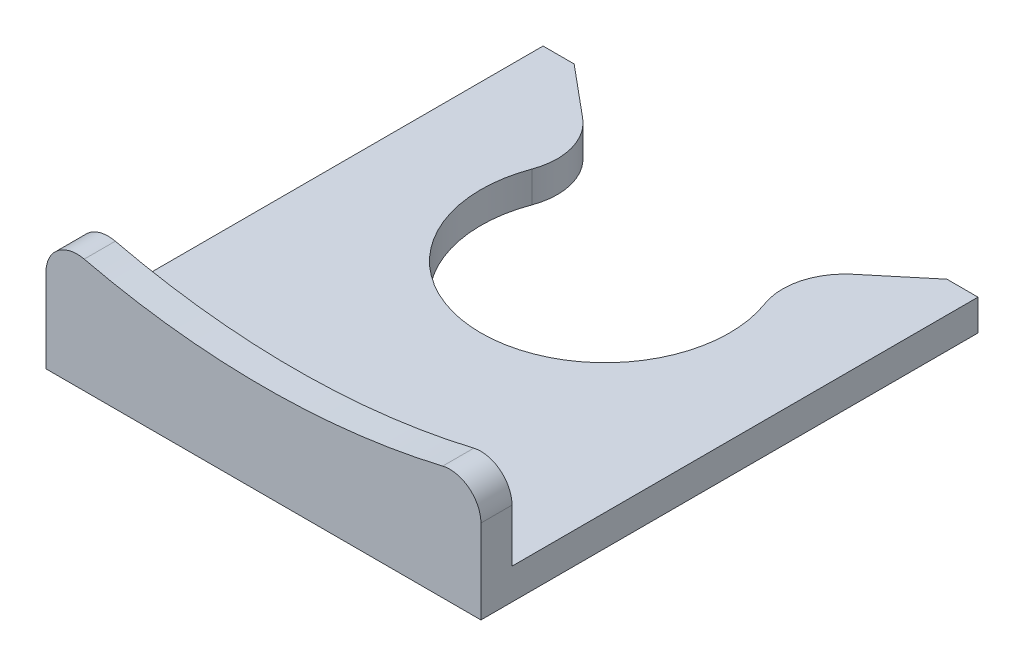
ISO-10303-21;
HEADER;
FILE_DESCRIPTION(('STEP AP214'),'2;1');
FILE_NAME('part.step','',(''),(''),'','','');
FILE_SCHEMA(('AUTOMOTIVE_DESIGN { 1 0 10303 214 1 1 1 1 }'));
ENDSEC;
DATA;
#1=APPLICATION_CONTEXT('core data for automotive mechanical design processes');
#2=APPLICATION_PROTOCOL_DEFINITION('international standard','automotive_design',2000,#1);
#3=PRODUCT_CONTEXT('',#1,'mechanical');
#4=PRODUCT('Part','Part','',(#3));
#5=PRODUCT_RELATED_PRODUCT_CATEGORY('part','',(#4));
#6=PRODUCT_DEFINITION_FORMATION('','',#4);
#7=PRODUCT_DEFINITION_CONTEXT('part definition',#1,'design');
#8=PRODUCT_DEFINITION('design','',#6,#7);
#9=PRODUCT_DEFINITION_SHAPE('','',#8);
#10=(LENGTH_UNIT() NAMED_UNIT(*) SI_UNIT(.MILLI.,.METRE.));
#11=(NAMED_UNIT(*) PLANE_ANGLE_UNIT() SI_UNIT($,.RADIAN.));
#12=(NAMED_UNIT(*) SI_UNIT($,.STERADIAN.) SOLID_ANGLE_UNIT());
#13=UNCERTAINTY_MEASURE_WITH_UNIT(LENGTH_MEASURE(1.E-05),#10,'distance_accuracy_value','');
#14=(GEOMETRIC_REPRESENTATION_CONTEXT(3) GLOBAL_UNCERTAINTY_ASSIGNED_CONTEXT((#13)) GLOBAL_UNIT_ASSIGNED_CONTEXT((#10,
#11,#12)) REPRESENTATION_CONTEXT('',''));
#15=CARTESIAN_POINT('',(0.,0.,0.));
#16=DIRECTION('',(0.,0.,1.));
#17=DIRECTION('',(1.,0.,0.));
#18=AXIS2_PLACEMENT_3D('',#15,#16,#17);
#19=CARTESIAN_POINT('',(5.62608460936985,1.,-5.08498728250599));
#20=DIRECTION('',(0.,1.,0.));
#21=DIRECTION('',(0.,0.,1.));
#22=AXIS2_PLACEMENT_3D('',#19,#20,#21);
#23=PLANE('',#22);
#24=DIRECTION('',(0.,0.,1.));
#25=VECTOR('',#24,1.);
#26=CARTESIAN_POINT('',(-7.,1.,-8.));
#27=LINE('',#26,#25);
#28=CARTESIAN_POINT('',(-7.,1.,-8.));
#29=VERTEX_POINT('',#28);
#30=CARTESIAN_POINT('',(-7.,1.,7.));
#31=VERTEX_POINT('',#30);
#32=EDGE_CURVE('E145',#29,#31,#27,.T.);
#33=ORIENTED_EDGE('',*,*,#32,.T.);
#34=DIRECTION('',(1.,0.,0.));
#35=VECTOR('',#34,1.);
#36=CARTESIAN_POINT('',(5.62608460936985,1.,7.));
#37=LINE('',#36,#35);
#38=CARTESIAN_POINT('',(7.,1.,7.));
#39=VERTEX_POINT('',#38);
#40=EDGE_CURVE('E141',#31,#39,#37,.T.);
#41=ORIENTED_EDGE('',*,*,#40,.T.);
#42=DIRECTION('',(0.,0.,-1.));
#43=VECTOR('',#42,1.);
#44=CARTESIAN_POINT('',(7.,1.,-8.));
#45=LINE('',#44,#43);
#46=CARTESIAN_POINT('',(7.,1.,-8.));
#47=VERTEX_POINT('',#46);
#48=EDGE_CURVE('E134',#39,#47,#45,.T.);
#49=ORIENTED_EDGE('',*,*,#48,.T.);
#50=DIRECTION('',(-1.,0.,0.));
#51=VECTOR('',#50,1.);
#52=CARTESIAN_POINT('',(6.,1.,-8.));
#53=LINE('',#52,#51);
#54=CARTESIAN_POINT('',(6.,1.,-8.));
#55=VERTEX_POINT('',#54);
#56=EDGE_CURVE('E138',#47,#55,#53,.T.);
#57=ORIENTED_EDGE('',*,*,#56,.T.);
#58=DIRECTION('',(-0.768221279597376,0.,0.64018439966448));
#59=VECTOR('',#58,1.);
#60=CARTESIAN_POINT('',(4.34571581004089,1.,-6.62142984170074));
#61=LINE('',#60,#59);
#62=CARTESIAN_POINT('',(4.34571581004089,1.,-6.62142984170074));
#63=VERTEX_POINT('',#62);
#64=EDGE_CURVE('E160',#55,#63,#61,.T.);
#65=ORIENTED_EDGE('',*,*,#64,.T.);
#66=CARTESIAN_POINT('',(5.62608460936985,1.,-5.08498728250599));
#67=DIRECTION('',(0.,1.,0.));
#68=DIRECTION('',(0.,0.,1.));
#69=AXIS2_PLACEMENT_3D('',#66,#67,#68);
#70=CIRCLE('',#69,2.);
#71=CARTESIAN_POINT('',(3.75072307291323,1.,-4.38999152167067));
#72=VERTEX_POINT('',#71);
#73=EDGE_CURVE('E162',#63,#72,#70,.T.);
#74=ORIENTED_EDGE('',*,*,#73,.T.);
#75=CARTESIAN_POINT('',(0.,1.,-3.));
#76=DIRECTION('',(0.,-1.,0.));
#77=DIRECTION('',(0.,0.,1.));
#78=AXIS2_PLACEMENT_3D('',#75,#76,#77);
#79=CIRCLE('',#78,4.);
#80=CARTESIAN_POINT('',(-3.75072307291323,1.,-4.38999152167066));
#81=VERTEX_POINT('',#80);
#82=EDGE_CURVE('E167',#72,#81,#79,.T.);
#83=ORIENTED_EDGE('',*,*,#82,.T.);
#84=CARTESIAN_POINT('',(-5.62608460936985,1.,-5.08498728250599));
#85=DIRECTION('',(0.,1.,0.));
#86=DIRECTION('',(0.,0.,-1.));
#87=AXIS2_PLACEMENT_3D('',#84,#85,#86);
#88=CIRCLE('',#87,2.);
#89=CARTESIAN_POINT('',(-4.34571581004089,1.,-6.62142984170074));
#90=VERTEX_POINT('',#89);
#91=EDGE_CURVE('E169',#81,#90,#88,.T.);
#92=ORIENTED_EDGE('',*,*,#91,.T.);
#93=DIRECTION('',(-0.768221279597376,0.,-0.64018439966448));
#94=VECTOR('',#93,1.);
#95=CARTESIAN_POINT('',(-4.34571581004089,1.,-6.62142984170074));
#96=LINE('',#95,#94);
#97=CARTESIAN_POINT('',(-6.,1.,-8.));
#98=VERTEX_POINT('',#97);
#99=EDGE_CURVE('E171',#90,#98,#96,.T.);
#100=ORIENTED_EDGE('',*,*,#99,.T.);
#101=DIRECTION('',(-1.,0.,0.));
#102=VECTOR('',#101,1.);
#103=CARTESIAN_POINT('',(-7.,1.,-8.));
#104=LINE('',#103,#102);
#105=EDGE_CURVE('E173',#98,#29,#104,.T.);
#106=ORIENTED_EDGE('',*,*,#105,.T.);
#107=EDGE_LOOP('',(#33,#41,#49,#57,#65,#74,#83,#92,#100,#106));
#108=FACE_BOUND('',#107,.T.);
#109=ADVANCED_FACE('F34',(#108),#23,.T.);
#110=CARTESIAN_POINT('',(-7.,1.,-8.));
#111=DIRECTION('',(1.,0.,0.));
#112=DIRECTION('',(0.,0.,-1.));
#113=AXIS2_PLACEMENT_3D('',#110,#111,#112);
#114=PLANE('',#113);
#115=DIRECTION('',(0.,-1.,0.));
#116=VECTOR('',#115,1.);
#117=CARTESIAN_POINT('',(-7.,1.,8.));
#118=LINE('',#117,#116);
#119=CARTESIAN_POINT('',(-7.,2.70177871865296,8.));
#120=VERTEX_POINT('',#119);
#121=CARTESIAN_POINT('',(-7.,0.,8.));
#122=VERTEX_POINT('',#121);
#123=EDGE_CURVE('E216',#120,#122,#118,.T.);
#124=ORIENTED_EDGE('',*,*,#123,.F.);
#125=DIRECTION('',(0.,0.,-1.));
#126=VECTOR('',#125,1.);
#127=CARTESIAN_POINT('',(-7.,2.70177871865296,7.));
#128=LINE('',#127,#126);
#129=CARTESIAN_POINT('',(-7.,2.70177871865296,7.));
#130=VERTEX_POINT('',#129);
#131=EDGE_CURVE('E11',#120,#130,#128,.T.);
#132=ORIENTED_EDGE('',*,*,#131,.T.);
#133=DIRECTION('',(0.,-1.,0.));
#134=VECTOR('',#133,1.);
#135=CARTESIAN_POINT('',(-7.,0.,7.));
#136=LINE('',#135,#134);
#137=EDGE_CURVE('E238',#130,#31,#136,.T.);
#138=ORIENTED_EDGE('',*,*,#137,.T.);
#139=ORIENTED_EDGE('',*,*,#32,.F.);
#140=DIRECTION('',(0.,-1.,0.));
#141=VECTOR('',#140,1.);
#142=CARTESIAN_POINT('',(-7.,1.,-8.));
#143=LINE('',#142,#141);
#144=CARTESIAN_POINT('',(-7.,0.,-8.));
#145=VERTEX_POINT('',#144);
#146=EDGE_CURVE('E175',#29,#145,#143,.T.);
#147=ORIENTED_EDGE('',*,*,#146,.T.);
#148=DIRECTION('',(0.,0.,1.));
#149=VECTOR('',#148,1.);
#150=CARTESIAN_POINT('',(-7.,0.,-8.));
#151=LINE('',#150,#149);
#152=EDGE_CURVE('E176',#145,#122,#151,.T.);
#153=ORIENTED_EDGE('',*,*,#152,.T.);
#154=EDGE_LOOP('',(#124,#132,#138,#139,#147,#153));
#155=FACE_BOUND('',#154,.T.);
#156=ADVANCED_FACE('F257',(#155),#114,.F.);
#157=CARTESIAN_POINT('',(-7.,1.,8.));
#158=DIRECTION('',(0.,0.,-1.));
#159=DIRECTION('',(-1.,0.,0.));
#160=AXIS2_PLACEMENT_3D('',#157,#158,#159);
#161=PLANE('',#160);
#162=DIRECTION('',(0.,-1.,0.));
#163=VECTOR('',#162,1.);
#164=CARTESIAN_POINT('',(7.,1.,8.));
#165=LINE('',#164,#163);
#166=CARTESIAN_POINT('',(7.,2.70177871865296,8.));
#167=VERTEX_POINT('',#166);
#168=CARTESIAN_POINT('',(7.,0.,8.));
#169=VERTEX_POINT('',#168);
#170=EDGE_CURVE('E154',#167,#169,#165,.T.);
#171=ORIENTED_EDGE('',*,*,#170,.F.);
#172=CARTESIAN_POINT('',(6.,2.70177871865296,8.));
#173=DIRECTION('',(0.,0.,-1.));
#174=DIRECTION('',(-1.,0.,0.));
#175=AXIS2_PLACEMENT_3D('',#172,#173,#174);
#176=CIRCLE('',#175,1.);
#177=CARTESIAN_POINT('',(5.76923076923077,3.674787229474,8.));
#178=VERTEX_POINT('',#177);
#179=EDGE_CURVE('E223',#167,#178,#176,.F.);
#180=ORIENTED_EDGE('',*,*,#179,.T.);
#181=CARTESIAN_POINT('',(0.,28.,8.));
#182=DIRECTION('',(0.,0.,-1.));
#183=DIRECTION('',(1.,0.,0.));
#184=AXIS2_PLACEMENT_3D('',#181,#182,#183);
#185=CIRCLE('',#184,25.);
#186=CARTESIAN_POINT('',(-5.76923076923077,3.674787229474,8.));
#187=VERTEX_POINT('',#186);
#188=EDGE_CURVE('E245',#178,#187,#185,.T.);
#189=ORIENTED_EDGE('',*,*,#188,.T.);
#190=CARTESIAN_POINT('',(-6.,2.70177871865296,8.));
#191=DIRECTION('',(0.,0.,-1.));
#192=DIRECTION('',(-1.,0.,0.));
#193=AXIS2_PLACEMENT_3D('',#190,#191,#192);
#194=CIRCLE('',#193,1.);
#195=EDGE_CURVE('E221',#187,#120,#194,.F.);
#196=ORIENTED_EDGE('',*,*,#195,.T.);
#197=ORIENTED_EDGE('',*,*,#123,.T.);
#198=DIRECTION('',(1.,0.,0.));
#199=VECTOR('',#198,1.);
#200=CARTESIAN_POINT('',(-7.,0.,8.));
#201=LINE('',#200,#199);
#202=EDGE_CURVE('E179',#122,#169,#201,.T.);
#203=ORIENTED_EDGE('',*,*,#202,.T.);
#204=EDGE_LOOP('',(#171,#180,#189,#196,#197,#203));
#205=FACE_BOUND('',#204,.T.);
#206=ADVANCED_FACE('F244',(#205),#161,.F.);
#207=CARTESIAN_POINT('',(7.,1.,-8.));
#208=DIRECTION('',(-1.,0.,0.));
#209=DIRECTION('',(0.,0.,1.));
#210=AXIS2_PLACEMENT_3D('',#207,#208,#209);
#211=PLANE('',#210);
#212=DIRECTION('',(0.,1.,0.));
#213=VECTOR('',#212,1.);
#214=CARTESIAN_POINT('',(7.,0.,7.));
#215=LINE('',#214,#213);
#216=CARTESIAN_POINT('',(7.,2.70177871865296,7.));
#217=VERTEX_POINT('',#216);
#218=EDGE_CURVE('E232',#39,#217,#215,.T.);
#219=ORIENTED_EDGE('',*,*,#218,.T.);
#220=DIRECTION('',(0.,0.,-1.));
#221=VECTOR('',#220,1.);
#222=CARTESIAN_POINT('',(7.,2.70177871865296,8.));
#223=LINE('',#222,#221);
#224=EDGE_CURVE('E218',#217,#167,#223,.F.);
#225=ORIENTED_EDGE('',*,*,#224,.T.);
#226=ORIENTED_EDGE('',*,*,#170,.T.);
#227=DIRECTION('',(0.,0.,-1.));
#228=VECTOR('',#227,1.);
#229=CARTESIAN_POINT('',(7.,0.,-8.));
#230=LINE('',#229,#228);
#231=CARTESIAN_POINT('',(7.,0.,-8.));
#232=VERTEX_POINT('',#231);
#233=EDGE_CURVE('E151',#169,#232,#230,.T.);
#234=ORIENTED_EDGE('',*,*,#233,.T.);
#235=DIRECTION('',(0.,-1.,0.));
#236=VECTOR('',#235,1.);
#237=CARTESIAN_POINT('',(7.,1.,-8.));
#238=LINE('',#237,#236);
#239=EDGE_CURVE('E148',#47,#232,#238,.T.);
#240=ORIENTED_EDGE('',*,*,#239,.F.);
#241=ORIENTED_EDGE('',*,*,#48,.F.);
#242=EDGE_LOOP('',(#219,#225,#226,#234,#240,#241));
#243=FACE_BOUND('',#242,.T.);
#244=ADVANCED_FACE('F149',(#243),#211,.F.);
#245=CARTESIAN_POINT('',(6.,1.,-8.));
#246=DIRECTION('',(0.,0.,1.));
#247=DIRECTION('',(1.,0.,0.));
#248=AXIS2_PLACEMENT_3D('',#245,#246,#247);
#249=PLANE('',#248);
#250=DIRECTION('',(-1.,0.,0.));
#251=VECTOR('',#250,1.);
#252=CARTESIAN_POINT('',(6.,0.,-8.));
#253=LINE('',#252,#251);
#254=CARTESIAN_POINT('',(6.,0.,-8.));
#255=VERTEX_POINT('',#254);
#256=EDGE_CURVE('E183',#232,#255,#253,.T.);
#257=ORIENTED_EDGE('',*,*,#256,.T.);
#258=DIRECTION('',(0.,-1.,0.));
#259=VECTOR('',#258,1.);
#260=CARTESIAN_POINT('',(6.,1.,-8.));
#261=LINE('',#260,#259);
#262=EDGE_CURVE('E155',#55,#255,#261,.T.);
#263=ORIENTED_EDGE('',*,*,#262,.F.);
#264=ORIENTED_EDGE('',*,*,#56,.F.);
#265=ORIENTED_EDGE('',*,*,#239,.T.);
#266=EDGE_LOOP('',(#257,#263,#264,#265));
#267=FACE_BOUND('',#266,.T.);
#268=ADVANCED_FACE('F157',(#267),#249,.F.);
#269=CARTESIAN_POINT('',(4.34571581004089,1.,-6.62142984170074));
#270=DIRECTION('',(0.64018439966448,0.,0.768221279597376));
#271=DIRECTION('',(0.768221279597376,0.,-0.64018439966448));
#272=AXIS2_PLACEMENT_3D('',#269,#270,#271);
#273=PLANE('',#272);
#274=DIRECTION('',(-0.768221279597376,0.,0.64018439966448));
#275=VECTOR('',#274,1.);
#276=CARTESIAN_POINT('',(4.34571581004089,0.,-6.62142984170074));
#277=LINE('',#276,#275);
#278=CARTESIAN_POINT('',(4.34571581004089,0.,-6.62142984170074));
#279=VERTEX_POINT('',#278);
#280=EDGE_CURVE('E185',#255,#279,#277,.T.);
#281=ORIENTED_EDGE('',*,*,#280,.T.);
#282=DIRECTION('',(0.,-1.,0.));
#283=VECTOR('',#282,1.);
#284=CARTESIAN_POINT('',(4.34571581004089,1.,-6.62142984170074));
#285=LINE('',#284,#283);
#286=EDGE_CURVE('E211',#63,#279,#285,.T.);
#287=ORIENTED_EDGE('',*,*,#286,.F.);
#288=ORIENTED_EDGE('',*,*,#64,.F.);
#289=ORIENTED_EDGE('',*,*,#262,.T.);
#290=EDGE_LOOP('',(#281,#287,#288,#289));
#291=FACE_BOUND('',#290,.T.);
#292=ADVANCED_FACE('F266',(#291),#273,.F.);
#293=CARTESIAN_POINT('',(5.62608460936985,1.,-5.08498728250599));
#294=DIRECTION('',(0.,-1.,0.));
#295=DIRECTION('',(0.,0.,-1.));
#296=AXIS2_PLACEMENT_3D('',#293,#294,#295);
#297=CYLINDRICAL_SURFACE('',#296,2.);
#298=CARTESIAN_POINT('',(5.62608460936985,0.,-5.08498728250599));
#299=DIRECTION('',(0.,1.,0.));
#300=DIRECTION('',(0.,0.,1.));
#301=AXIS2_PLACEMENT_3D('',#298,#299,#300);
#302=CIRCLE('',#301,2.);
#303=CARTESIAN_POINT('',(3.75072307291323,0.,-4.38999152167067));
#304=VERTEX_POINT('',#303);
#305=EDGE_CURVE('E187',#279,#304,#302,.T.);
#306=ORIENTED_EDGE('',*,*,#305,.T.);
#307=DIRECTION('',(0.,-1.,0.));
#308=VECTOR('',#307,1.);
#309=CARTESIAN_POINT('',(3.75072307291323,1.,-4.38999152167067));
#310=LINE('',#309,#308);
#311=EDGE_CURVE('E208',#72,#304,#310,.T.);
#312=ORIENTED_EDGE('',*,*,#311,.F.);
#313=ORIENTED_EDGE('',*,*,#73,.F.);
#314=ORIENTED_EDGE('',*,*,#286,.T.);
#315=EDGE_LOOP('',(#306,#312,#313,#314));
#316=FACE_BOUND('',#315,.T.);
#317=ADVANCED_FACE('F273',(#316),#297,.T.);
#318=CARTESIAN_POINT('',(0.,1.,-3.));
#319=DIRECTION('',(0.,-1.,0.));
#320=DIRECTION('',(0.,0.,-1.));
#321=AXIS2_PLACEMENT_3D('',#318,#319,#320);
#322=CYLINDRICAL_SURFACE('',#321,4.);
#323=CARTESIAN_POINT('',(0.,0.,-3.));
#324=DIRECTION('',(0.,-1.,0.));
#325=DIRECTION('',(0.,0.,1.));
#326=AXIS2_PLACEMENT_3D('',#323,#324,#325);
#327=CIRCLE('',#326,4.);
#328=CARTESIAN_POINT('',(-3.75072307291323,0.,-4.38999152167066));
#329=VERTEX_POINT('',#328);
#330=EDGE_CURVE('E189',#304,#329,#327,.T.);
#331=ORIENTED_EDGE('',*,*,#330,.T.);
#332=DIRECTION('',(0.,-1.,0.));
#333=VECTOR('',#332,1.);
#334=CARTESIAN_POINT('',(-3.75072307291323,1.,-4.38999152167066));
#335=LINE('',#334,#333);
#336=EDGE_CURVE('E205',#81,#329,#335,.T.);
#337=ORIENTED_EDGE('',*,*,#336,.F.);
#338=ORIENTED_EDGE('',*,*,#82,.F.);
#339=ORIENTED_EDGE('',*,*,#311,.T.);
#340=EDGE_LOOP('',(#331,#337,#338,#339));
#341=FACE_BOUND('',#340,.T.);
#342=ADVANCED_FACE('F276',(#341),#322,.F.);
#343=CARTESIAN_POINT('',(-5.62608460936985,1.,-5.08498728250599));
#344=DIRECTION('',(0.,-1.,0.));
#345=DIRECTION('',(0.,0.,-1.));
#346=AXIS2_PLACEMENT_3D('',#343,#344,#345);
#347=CYLINDRICAL_SURFACE('',#346,2.);
#348=CARTESIAN_POINT('',(-5.62608460936985,0.,-5.08498728250599));
#349=DIRECTION('',(0.,1.,0.));
#350=DIRECTION('',(0.,0.,-1.));
#351=AXIS2_PLACEMENT_3D('',#348,#349,#350);
#352=CIRCLE('',#351,2.);
#353=CARTESIAN_POINT('',(-4.34571581004089,0.,-6.62142984170074));
#354=VERTEX_POINT('',#353);
#355=EDGE_CURVE('E191',#329,#354,#352,.T.);
#356=ORIENTED_EDGE('',*,*,#355,.T.);
#357=DIRECTION('',(0.,-1.,0.));
#358=VECTOR('',#357,1.);
#359=CARTESIAN_POINT('',(-4.34571581004089,1.,-6.62142984170074));
#360=LINE('',#359,#358);
#361=EDGE_CURVE('E202',#90,#354,#360,.T.);
#362=ORIENTED_EDGE('',*,*,#361,.F.);
#363=ORIENTED_EDGE('',*,*,#91,.F.);
#364=ORIENTED_EDGE('',*,*,#336,.T.);
#365=EDGE_LOOP('',(#356,#362,#363,#364));
#366=FACE_BOUND('',#365,.T.);
#367=ADVANCED_FACE('F281',(#366),#347,.T.);
#368=CARTESIAN_POINT('',(-4.34571581004089,1.,-6.62142984170074));
#369=DIRECTION('',(-0.64018439966448,0.,0.768221279597376));
#370=DIRECTION('',(0.768221279597376,0.,0.64018439966448));
#371=AXIS2_PLACEMENT_3D('',#368,#369,#370);
#372=PLANE('',#371);
#373=DIRECTION('',(-0.768221279597376,0.,-0.64018439966448));
#374=VECTOR('',#373,1.);
#375=CARTESIAN_POINT('',(-4.34571581004089,0.,-6.62142984170074));
#376=LINE('',#375,#374);
#377=CARTESIAN_POINT('',(-6.,0.,-8.));
#378=VERTEX_POINT('',#377);
#379=EDGE_CURVE('E193',#354,#378,#376,.T.);
#380=ORIENTED_EDGE('',*,*,#379,.T.);
#381=DIRECTION('',(0.,-1.,0.));
#382=VECTOR('',#381,1.);
#383=CARTESIAN_POINT('',(-6.,1.,-8.));
#384=LINE('',#383,#382);
#385=EDGE_CURVE('E199',#98,#378,#384,.T.);
#386=ORIENTED_EDGE('',*,*,#385,.F.);
#387=ORIENTED_EDGE('',*,*,#99,.F.);
#388=ORIENTED_EDGE('',*,*,#361,.T.);
#389=EDGE_LOOP('',(#380,#386,#387,#388));
#390=FACE_BOUND('',#389,.T.);
#391=ADVANCED_FACE('F285',(#390),#372,.F.);
#392=CARTESIAN_POINT('',(-7.,1.,-8.));
#393=DIRECTION('',(0.,0.,1.));
#394=DIRECTION('',(1.,0.,0.));
#395=AXIS2_PLACEMENT_3D('',#392,#393,#394);
#396=PLANE('',#395);
#397=DIRECTION('',(-1.,0.,0.));
#398=VECTOR('',#397,1.);
#399=CARTESIAN_POINT('',(-7.,0.,-8.));
#400=LINE('',#399,#398);
#401=EDGE_CURVE('E195',#378,#145,#400,.T.);
#402=ORIENTED_EDGE('',*,*,#401,.T.);
#403=ORIENTED_EDGE('',*,*,#146,.F.);
#404=ORIENTED_EDGE('',*,*,#105,.F.);
#405=ORIENTED_EDGE('',*,*,#385,.T.);
#406=EDGE_LOOP('',(#402,#403,#404,#405));
#407=FACE_BOUND('',#406,.T.);
#408=ADVANCED_FACE('F288',(#407),#396,.F.);
#409=CARTESIAN_POINT('',(5.62608460936985,0.,-5.08498728250599));
#410=DIRECTION('',(0.,1.,0.));
#411=DIRECTION('',(0.,0.,1.));
#412=AXIS2_PLACEMENT_3D('',#409,#410,#411);
#413=PLANE('',#412);
#414=ORIENTED_EDGE('',*,*,#202,.F.);
#415=ORIENTED_EDGE('',*,*,#152,.F.);
#416=ORIENTED_EDGE('',*,*,#401,.F.);
#417=ORIENTED_EDGE('',*,*,#379,.F.);
#418=ORIENTED_EDGE('',*,*,#355,.F.);
#419=ORIENTED_EDGE('',*,*,#330,.F.);
#420=ORIENTED_EDGE('',*,*,#305,.F.);
#421=ORIENTED_EDGE('',*,*,#280,.F.);
#422=ORIENTED_EDGE('',*,*,#256,.F.);
#423=ORIENTED_EDGE('',*,*,#233,.F.);
#424=EDGE_LOOP('',(#414,#415,#416,#417,#418,#419,#420,#421,#422,#423));
#425=FACE_BOUND('',#424,.T.);
#426=ADVANCED_FACE('F262',(#425),#413,.F.);
#427=CARTESIAN_POINT('',(0.,28.,7.));
#428=DIRECTION('',(0.,0.,1.));
#429=DIRECTION('',(1.,0.,0.));
#430=AXIS2_PLACEMENT_3D('',#427,#428,#429);
#431=CYLINDRICAL_SURFACE('',#430,25.);
#432=ORIENTED_EDGE('',*,*,#188,.F.);
#433=DIRECTION('',(0.,0.,1.));
#434=VECTOR('',#433,1.);
#435=CARTESIAN_POINT('',(5.76923076923077,3.674787229474,7.));
#436=LINE('',#435,#434);
#437=CARTESIAN_POINT('',(5.76923076923077,3.674787229474,7.));
#438=VERTEX_POINT('',#437);
#439=EDGE_CURVE('E228',#178,#438,#436,.F.);
#440=ORIENTED_EDGE('',*,*,#439,.T.);
#441=CARTESIAN_POINT('',(0.,28.,7.));
#442=DIRECTION('',(0.,0.,-1.));
#443=DIRECTION('',(1.,0.,0.));
#444=AXIS2_PLACEMENT_3D('',#441,#442,#443);
#445=CIRCLE('',#444,25.);
#446=CARTESIAN_POINT('',(-5.76923076923077,3.674787229474,7.));
#447=VERTEX_POINT('',#446);
#448=EDGE_CURVE('E233',#438,#447,#445,.T.);
#449=ORIENTED_EDGE('',*,*,#448,.T.);
#450=DIRECTION('',(0.,0.,1.));
#451=VECTOR('',#450,1.);
#452=CARTESIAN_POINT('',(-5.76923076923077,3.674787229474,7.));
#453=LINE('',#452,#451);
#454=EDGE_CURVE('E225',#447,#187,#453,.T.);
#455=ORIENTED_EDGE('',*,*,#454,.T.);
#456=EDGE_LOOP('',(#432,#440,#449,#455));
#457=FACE_BOUND('',#456,.T.);
#458=ADVANCED_FACE('F247',(#457),#431,.F.);
#459=CARTESIAN_POINT('',(0.,28.,7.));
#460=DIRECTION('',(0.,0.,1.));
#461=DIRECTION('',(1.,0.,0.));
#462=AXIS2_PLACEMENT_3D('',#459,#460,#461);
#463=PLANE('',#462);
#464=ORIENTED_EDGE('',*,*,#448,.F.);
#465=CARTESIAN_POINT('',(6.,2.70177871865296,7.));
#466=DIRECTION('',(0.,0.,1.));
#467=DIRECTION('',(1.,0.,0.));
#468=AXIS2_PLACEMENT_3D('',#465,#466,#467);
#469=CIRCLE('',#468,1.);
#470=EDGE_CURVE('E42',#438,#217,#469,.F.);
#471=ORIENTED_EDGE('',*,*,#470,.T.);
#472=ORIENTED_EDGE('',*,*,#218,.F.);
#473=ORIENTED_EDGE('',*,*,#40,.F.);
#474=ORIENTED_EDGE('',*,*,#137,.F.);
#475=CARTESIAN_POINT('',(-6.,2.70177871865296,7.));
#476=DIRECTION('',(0.,0.,1.));
#477=DIRECTION('',(1.,0.,0.));
#478=AXIS2_PLACEMENT_3D('',#475,#476,#477);
#479=CIRCLE('',#478,1.);
#480=EDGE_CURVE('E54',#130,#447,#479,.F.);
#481=ORIENTED_EDGE('',*,*,#480,.T.);
#482=EDGE_LOOP('',(#464,#471,#472,#473,#474,#481));
#483=FACE_BOUND('',#482,.T.);
#484=ADVANCED_FACE('F231',(#483),#463,.F.);
#485=CARTESIAN_POINT('',(6.,2.70177871865296,7.));
#486=DIRECTION('',(0.,0.,1.));
#487=DIRECTION('',(1.,0.,0.));
#488=AXIS2_PLACEMENT_3D('',#485,#486,#487);
#489=CYLINDRICAL_SURFACE('',#488,1.);
#490=ORIENTED_EDGE('',*,*,#470,.F.);
#491=ORIENTED_EDGE('',*,*,#439,.F.);
#492=ORIENTED_EDGE('',*,*,#179,.F.);
#493=ORIENTED_EDGE('',*,*,#224,.F.);
#494=EDGE_LOOP('',(#490,#491,#492,#493));
#495=FACE_BOUND('',#494,.T.);
#496=ADVANCED_FACE('F240',(#495),#489,.T.);
#497=CARTESIAN_POINT('',(-6.,2.70177871865296,7.));
#498=DIRECTION('',(0.,0.,1.));
#499=DIRECTION('',(1.,0.,0.));
#500=AXIS2_PLACEMENT_3D('',#497,#498,#499);
#501=CYLINDRICAL_SURFACE('',#500,1.);
#502=ORIENTED_EDGE('',*,*,#480,.F.);
#503=ORIENTED_EDGE('',*,*,#131,.F.);
#504=ORIENTED_EDGE('',*,*,#195,.F.);
#505=ORIENTED_EDGE('',*,*,#454,.F.);
#506=EDGE_LOOP('',(#502,#503,#504,#505));
#507=FACE_BOUND('',#506,.T.);
#508=ADVANCED_FACE('F36',(#507),#501,.T.);
#509=CLOSED_SHELL('',(#109,#156,#206,#244,#268,#292,#317,#342,#367,#391,#408,#426,#458,#484,
#496,#508));
#510=MANIFOLD_SOLID_BREP('B2',#509);
#511=ADVANCED_BREP_SHAPE_REPRESENTATION('',(#18,#510),#14);
#512=SHAPE_DEFINITION_REPRESENTATION(#9,#511);
ENDSEC;
END-ISO-10303-21;
